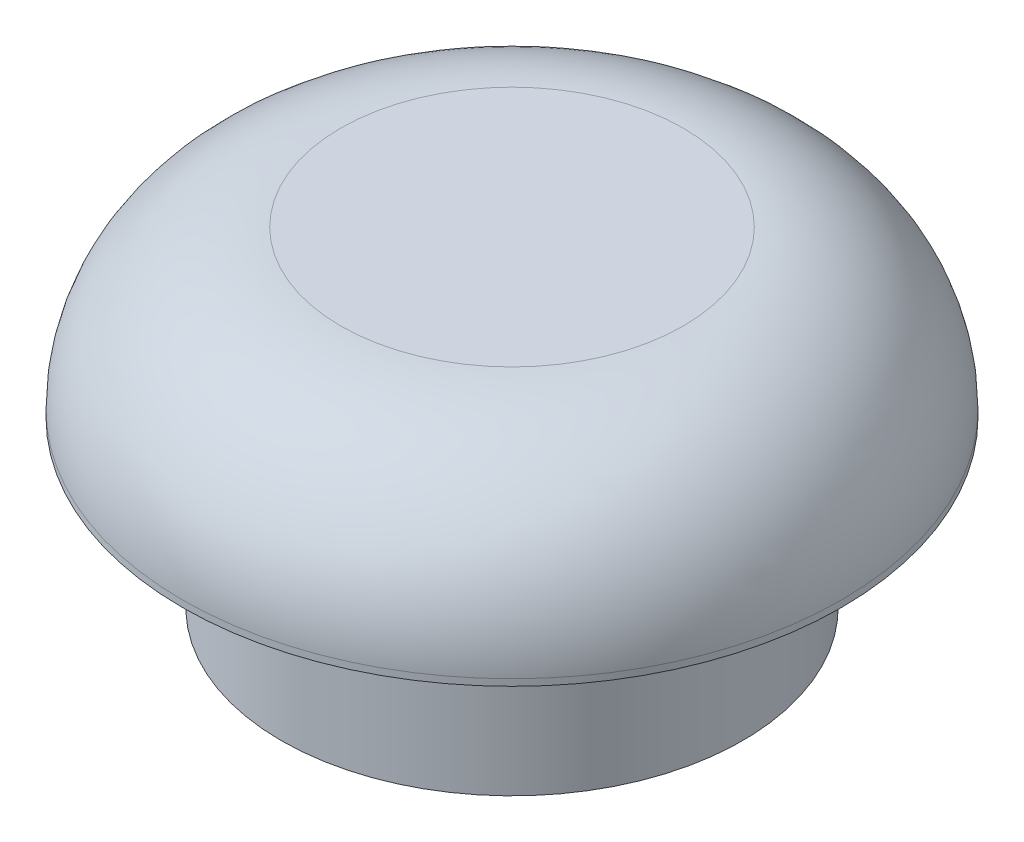
ISO-10303-21;
HEADER;
FILE_DESCRIPTION(('STEP AP214'),'2;1');
FILE_NAME('part.step','',(''),(''),'','','');
FILE_SCHEMA(('AUTOMOTIVE_DESIGN { 1 0 10303 214 1 1 1 1 }'));
ENDSEC;
DATA;
#1=APPLICATION_CONTEXT('core data for automotive mechanical design processes');
#2=APPLICATION_PROTOCOL_DEFINITION('international standard','automotive_design',2000,#1);
#3=PRODUCT_CONTEXT('',#1,'mechanical');
#4=PRODUCT('Part','Part','',(#3));
#5=PRODUCT_RELATED_PRODUCT_CATEGORY('part','',(#4));
#6=PRODUCT_DEFINITION_FORMATION('','',#4);
#7=PRODUCT_DEFINITION_CONTEXT('part definition',#1,'design');
#8=PRODUCT_DEFINITION('design','',#6,#7);
#9=PRODUCT_DEFINITION_SHAPE('','',#8);
#10=(LENGTH_UNIT() NAMED_UNIT(*) SI_UNIT(.MILLI.,.METRE.));
#11=(NAMED_UNIT(*) PLANE_ANGLE_UNIT() SI_UNIT($,.RADIAN.));
#12=(NAMED_UNIT(*) SI_UNIT($,.STERADIAN.) SOLID_ANGLE_UNIT());
#13=UNCERTAINTY_MEASURE_WITH_UNIT(LENGTH_MEASURE(1.E-05),#10,'distance_accuracy_value','');
#14=(GEOMETRIC_REPRESENTATION_CONTEXT(3) GLOBAL_UNCERTAINTY_ASSIGNED_CONTEXT((#13)) GLOBAL_UNIT_ASSIGNED_CONTEXT((#10,
#11,#12)) REPRESENTATION_CONTEXT('',''));
#15=CARTESIAN_POINT('',(0.,0.,0.));
#16=DIRECTION('',(0.,0.,1.));
#17=DIRECTION('',(1.,0.,0.));
#18=AXIS2_PLACEMENT_3D('',#15,#16,#17);
#19=CARTESIAN_POINT('',(0.,11.8389323578373,0.));
#20=DIRECTION('',(0.,1.,0.));
#21=DIRECTION('',(0.,0.,1.));
#22=AXIS2_PLACEMENT_3D('',#19,#20,#21);
#23=TOROIDAL_SURFACE('',#22,2.6,2.4);
#24=CARTESIAN_POINT('',(0.,11.8389323578373,0.));
#25=DIRECTION('',(0.,1.,0.));
#26=DIRECTION('',(0.,0.,1.));
#27=AXIS2_PLACEMENT_3D('',#24,#25,#26);
#28=CIRCLE('',#27,5.);
#29=CARTESIAN_POINT('',(0.,11.8389323578373,5.));
#30=VERTEX_POINT('',#29);
#31=EDGE_CURVE('E10',#30,#30,#28,.T.);
#32=ORIENTED_EDGE('',*,*,#31,.T.);
#33=EDGE_LOOP('',(#32));
#34=FACE_BOUND('',#33,.T.);
#35=CARTESIAN_POINT('',(0.,14.2389323578373,0.));
#36=DIRECTION('',(0.,1.,0.));
#37=DIRECTION('',(0.,0.,1.));
#38=AXIS2_PLACEMENT_3D('',#35,#36,#37);
#39=CIRCLE('',#38,2.59999999999998);
#40=CARTESIAN_POINT('',(0.,14.2389323578373,2.59999999999998));
#41=VERTEX_POINT('',#40);
#42=EDGE_CURVE('E60',#41,#41,#39,.T.);
#43=ORIENTED_EDGE('',*,*,#42,.F.);
#44=EDGE_LOOP('',(#43));
#45=FACE_BOUND('',#44,.T.);
#46=ADVANCED_FACE('F35',(#34,#45),#23,.T.);
#47=CARTESIAN_POINT('',(0.,36.9546475843752,0.));
#48=DIRECTION('',(0.,1.,0.));
#49=DIRECTION('',(0.,0.,1.));
#50=AXIS2_PLACEMENT_3D('',#47,#48,#49);
#51=CYLINDRICAL_SURFACE('',#50,5.);
#52=CARTESIAN_POINT('',(0.,11.7389323578373,0.));
#53=DIRECTION('',(0.,1.,0.));
#54=DIRECTION('',(0.,0.,1.));
#55=AXIS2_PLACEMENT_3D('',#52,#53,#54);
#56=CIRCLE('',#55,5.);
#57=CARTESIAN_POINT('',(0.,11.7389323578373,5.));
#58=VERTEX_POINT('',#57);
#59=EDGE_CURVE('E41',#58,#58,#56,.T.);
#60=ORIENTED_EDGE('',*,*,#59,.T.);
#61=EDGE_LOOP('',(#60));
#62=FACE_BOUND('',#61,.T.);
#63=ORIENTED_EDGE('',*,*,#31,.F.);
#64=EDGE_LOOP('',(#63));
#65=FACE_BOUND('',#64,.T.);
#66=ADVANCED_FACE('F67',(#62,#65),#51,.T.);
#67=CARTESIAN_POINT('',(-3.5,11.7389323578373,0.));
#68=DIRECTION('',(0.,-1.,0.));
#69=DIRECTION('',(0.,0.,-1.));
#70=AXIS2_PLACEMENT_3D('',#67,#68,#69);
#71=PLANE('',#70);
#72=CARTESIAN_POINT('',(0.,11.7389323578373,0.));
#73=DIRECTION('',(0.,1.,0.));
#74=DIRECTION('',(0.,0.,1.));
#75=AXIS2_PLACEMENT_3D('',#72,#73,#74);
#76=CIRCLE('',#75,3.5);
#77=CARTESIAN_POINT('',(0.,11.7389323578373,3.5));
#78=VERTEX_POINT('',#77);
#79=EDGE_CURVE('E45',#78,#78,#76,.T.);
#80=ORIENTED_EDGE('',*,*,#79,.T.);
#81=EDGE_LOOP('',(#80));
#82=FACE_BOUND('',#81,.T.);
#83=ORIENTED_EDGE('',*,*,#59,.F.);
#84=EDGE_LOOP('',(#83));
#85=FACE_BOUND('',#84,.T.);
#86=ADVANCED_FACE('F71',(#82,#85),#71,.T.);
#87=CARTESIAN_POINT('',(0.,36.9546475843752,0.));
#88=DIRECTION('',(0.,1.,0.));
#89=DIRECTION('',(0.,0.,1.));
#90=AXIS2_PLACEMENT_3D('',#87,#88,#89);
#91=CYLINDRICAL_SURFACE('',#90,3.5);
#92=CARTESIAN_POINT('',(0.,9.23893235783732,0.));
#93=DIRECTION('',(0.,1.,0.));
#94=DIRECTION('',(0.,0.,1.));
#95=AXIS2_PLACEMENT_3D('',#92,#93,#94);
#96=CIRCLE('',#95,3.5);
#97=CARTESIAN_POINT('',(0.,9.23893235783732,3.5));
#98=VERTEX_POINT('',#97);
#99=EDGE_CURVE('E49',#98,#98,#96,.T.);
#100=ORIENTED_EDGE('',*,*,#99,.T.);
#101=EDGE_LOOP('',(#100));
#102=FACE_BOUND('',#101,.T.);
#103=ORIENTED_EDGE('',*,*,#79,.F.);
#104=EDGE_LOOP('',(#103));
#105=FACE_BOUND('',#104,.T.);
#106=ADVANCED_FACE('F75',(#102,#105),#91,.T.);
#107=CARTESIAN_POINT('',(-1.55,9.23893235783732,0.));
#108=DIRECTION('',(0.,-1.,0.));
#109=DIRECTION('',(0.,0.,-1.));
#110=AXIS2_PLACEMENT_3D('',#107,#108,#109);
#111=PLANE('',#110);
#112=CARTESIAN_POINT('',(0.,9.23893235783732,0.));
#113=DIRECTION('',(0.,1.,0.));
#114=DIRECTION('',(0.,0.,1.));
#115=AXIS2_PLACEMENT_3D('',#112,#113,#114);
#116=CIRCLE('',#115,1.55);
#117=CARTESIAN_POINT('',(0.,9.23893235783732,1.55));
#118=VERTEX_POINT('',#117);
#119=EDGE_CURVE('E54',#118,#118,#116,.T.);
#120=ORIENTED_EDGE('',*,*,#119,.T.);
#121=EDGE_LOOP('',(#120));
#122=FACE_BOUND('',#121,.T.);
#123=ORIENTED_EDGE('',*,*,#99,.F.);
#124=EDGE_LOOP('',(#123));
#125=FACE_BOUND('',#124,.T.);
#126=ADVANCED_FACE('F82',(#122,#125),#111,.T.);
#127=CARTESIAN_POINT('',(0.,36.9546475843752,0.));
#128=DIRECTION('',(0.,1.,0.));
#129=DIRECTION('',(0.,0.,1.));
#130=AXIS2_PLACEMENT_3D('',#127,#128,#129);
#131=CYLINDRICAL_SURFACE('',#130,1.55);
#132=CARTESIAN_POINT('',(0.,13.2389323578373,0.));
#133=DIRECTION('',(0.,1.,0.));
#134=DIRECTION('',(0.,0.,1.));
#135=AXIS2_PLACEMENT_3D('',#132,#133,#134);
#136=CIRCLE('',#135,1.55);
#137=CARTESIAN_POINT('',(0.,13.2389323578373,1.55));
#138=VERTEX_POINT('',#137);
#139=EDGE_CURVE('E57',#138,#138,#136,.T.);
#140=ORIENTED_EDGE('',*,*,#139,.T.);
#141=EDGE_LOOP('',(#140));
#142=FACE_BOUND('',#141,.T.);
#143=ORIENTED_EDGE('',*,*,#119,.F.);
#144=EDGE_LOOP('',(#143));
#145=FACE_BOUND('',#144,.T.);
#146=ADVANCED_FACE('F86',(#142,#145),#131,.F.);
#147=CARTESIAN_POINT('',(0.,13.2389323578373,0.));
#148=DIRECTION('',(0.,-1.,0.));
#149=DIRECTION('',(0.,0.,-1.));
#150=AXIS2_PLACEMENT_3D('',#147,#148,#149);
#151=PLANE('',#150);
#152=ORIENTED_EDGE('',*,*,#139,.F.);
#153=EDGE_LOOP('',(#152));
#154=FACE_BOUND('',#153,.T.);
#155=ADVANCED_FACE('F90',(#154),#151,.T.);
#156=CARTESIAN_POINT('',(-2.59999999999998,14.2389323578373,0.));
#157=DIRECTION('',(0.,1.,0.));
#158=DIRECTION('',(0.,0.,1.));
#159=AXIS2_PLACEMENT_3D('',#156,#157,#158);
#160=PLANE('',#159);
#161=ORIENTED_EDGE('',*,*,#42,.T.);
#162=EDGE_LOOP('',(#161));
#163=FACE_BOUND('',#162,.T.);
#164=ADVANCED_FACE('F64',(#163),#160,.T.);
#165=CLOSED_SHELL('',(#46,#66,#86,#106,#126,#146,#155,#164));
#166=MANIFOLD_SOLID_BREP('B2',#165);
#167=ADVANCED_BREP_SHAPE_REPRESENTATION('',(#18,#166),#14);
#168=SHAPE_DEFINITION_REPRESENTATION(#9,#167);
ENDSEC;
END-ISO-10303-21;
